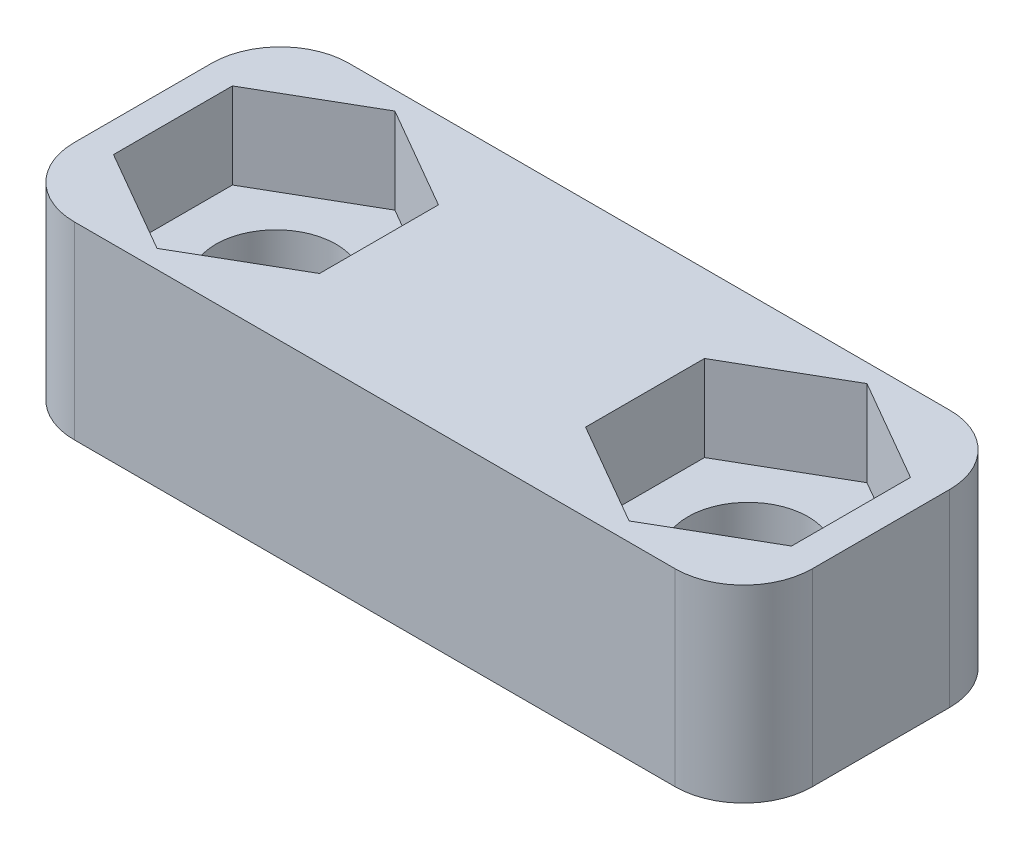
ISO-10303-21;
HEADER;
FILE_DESCRIPTION(('STEP AP214'),'2;1');
FILE_NAME('part.step','',(''),(''),'','','');
FILE_SCHEMA(('AUTOMOTIVE_DESIGN { 1 0 10303 214 1 1 1 1 }'));
ENDSEC;
DATA;
#1=APPLICATION_CONTEXT('core data for automotive mechanical design processes');
#2=APPLICATION_PROTOCOL_DEFINITION('international standard','automotive_design',2000,#1);
#3=PRODUCT_CONTEXT('',#1,'mechanical');
#4=PRODUCT('Part','Part','',(#3));
#5=PRODUCT_RELATED_PRODUCT_CATEGORY('part','',(#4));
#6=PRODUCT_DEFINITION_FORMATION('','',#4);
#7=PRODUCT_DEFINITION_CONTEXT('part definition',#1,'design');
#8=PRODUCT_DEFINITION('design','',#6,#7);
#9=PRODUCT_DEFINITION_SHAPE('','',#8);
#10=(LENGTH_UNIT() NAMED_UNIT(*) SI_UNIT(.MILLI.,.METRE.));
#11=(NAMED_UNIT(*) PLANE_ANGLE_UNIT() SI_UNIT($,.RADIAN.));
#12=(NAMED_UNIT(*) SI_UNIT($,.STERADIAN.) SOLID_ANGLE_UNIT());
#13=UNCERTAINTY_MEASURE_WITH_UNIT(LENGTH_MEASURE(1.E-05),#10,'distance_accuracy_value','');
#14=(GEOMETRIC_REPRESENTATION_CONTEXT(3) GLOBAL_UNCERTAINTY_ASSIGNED_CONTEXT((#13)) GLOBAL_UNIT_ASSIGNED_CONTEXT((#10,
#11,#12)) REPRESENTATION_CONTEXT('',''));
#15=CARTESIAN_POINT('',(0.,0.,0.));
#16=DIRECTION('',(0.,0.,1.));
#17=DIRECTION('',(1.,0.,0.));
#18=AXIS2_PLACEMENT_3D('',#15,#16,#17);
#19=CARTESIAN_POINT('',(0.,-5.5,8.));
#20=DIRECTION('',(0.,1.,0.));
#21=DIRECTION('',(0.,0.,1.));
#22=AXIS2_PLACEMENT_3D('',#19,#20,#21);
#23=PLANE('',#22);
#24=DIRECTION('',(0.,0.,-1.));
#25=VECTOR('',#24,1.);
#26=CARTESIAN_POINT('',(0.,-5.5,8.));
#27=LINE('',#26,#25);
#28=CARTESIAN_POINT('',(0.,-5.5,6.));
#29=VERTEX_POINT('',#28);
#30=CARTESIAN_POINT('',(0.,-5.5,2.));
#31=VERTEX_POINT('',#30);
#32=EDGE_CURVE('E403',#29,#31,#27,.T.);
#33=ORIENTED_EDGE('',*,*,#32,.T.);
#34=CARTESIAN_POINT('',(2.,-5.5,2.));
#35=DIRECTION('',(0.,1.,0.));
#36=DIRECTION('',(0.,0.,1.));
#37=AXIS2_PLACEMENT_3D('',#34,#35,#36);
#38=CIRCLE('',#37,2.);
#39=CARTESIAN_POINT('',(2.,-5.5,0.));
#40=VERTEX_POINT('',#39);
#41=EDGE_CURVE('E424',#31,#40,#38,.F.);
#42=ORIENTED_EDGE('',*,*,#41,.T.);
#43=DIRECTION('',(1.,0.,0.));
#44=VECTOR('',#43,1.);
#45=CARTESIAN_POINT('',(0.,-5.5,0.));
#46=LINE('',#45,#44);
#47=CARTESIAN_POINT('',(19.5,-5.5,0.));
#48=VERTEX_POINT('',#47);
#49=EDGE_CURVE('E391',#40,#48,#46,.T.);
#50=ORIENTED_EDGE('',*,*,#49,.T.);
#51=CARTESIAN_POINT('',(19.5,-5.5,2.));
#52=DIRECTION('',(0.,1.,0.));
#53=DIRECTION('',(0.,0.,1.));
#54=AXIS2_PLACEMENT_3D('',#51,#52,#53);
#55=CIRCLE('',#54,2.);
#56=CARTESIAN_POINT('',(21.5,-5.5,2.));
#57=VERTEX_POINT('',#56);
#58=EDGE_CURVE('E418',#48,#57,#55,.F.);
#59=ORIENTED_EDGE('',*,*,#58,.T.);
#60=DIRECTION('',(0.,0.,-1.));
#61=VECTOR('',#60,1.);
#62=CARTESIAN_POINT('',(21.5,-5.5,8.));
#63=LINE('',#62,#61);
#64=CARTESIAN_POINT('',(21.5,-5.5,6.));
#65=VERTEX_POINT('',#64);
#66=EDGE_CURVE('E400',#65,#57,#63,.T.);
#67=ORIENTED_EDGE('',*,*,#66,.F.);
#68=CARTESIAN_POINT('',(19.5,-5.5,6.));
#69=DIRECTION('',(0.,1.,0.));
#70=DIRECTION('',(0.,0.,1.));
#71=AXIS2_PLACEMENT_3D('',#68,#69,#70);
#72=CIRCLE('',#71,2.);
#73=CARTESIAN_POINT('',(19.5,-5.5,8.));
#74=VERTEX_POINT('',#73);
#75=EDGE_CURVE('E420',#65,#74,#72,.F.);
#76=ORIENTED_EDGE('',*,*,#75,.T.);
#77=DIRECTION('',(1.,0.,0.));
#78=VECTOR('',#77,1.);
#79=CARTESIAN_POINT('',(0.,-5.5,8.));
#80=LINE('',#79,#78);
#81=CARTESIAN_POINT('',(2.,-5.5,8.));
#82=VERTEX_POINT('',#81);
#83=EDGE_CURVE('E390',#82,#74,#80,.T.);
#84=ORIENTED_EDGE('',*,*,#83,.F.);
#85=CARTESIAN_POINT('',(2.,-5.5,6.));
#86=DIRECTION('',(0.,1.,0.));
#87=DIRECTION('',(0.,0.,1.));
#88=AXIS2_PLACEMENT_3D('',#85,#86,#87);
#89=CIRCLE('',#88,2.);
#90=EDGE_CURVE('E422',#82,#29,#89,.F.);
#91=ORIENTED_EDGE('',*,*,#90,.T.);
#92=EDGE_LOOP('',(#33,#42,#50,#59,#67,#76,#84,#91));
#93=FACE_BOUND('',#92,.T.);
#94=CARTESIAN_POINT('',(17.625,-5.5,4.));
#95=DIRECTION('',(0.,-1.,0.));
#96=DIRECTION('',(0.,0.,-1.));
#97=AXIS2_PLACEMENT_3D('',#94,#95,#96);
#98=CIRCLE('',#97,1.75);
#99=CARTESIAN_POINT('',(17.625,-5.5,2.25));
#100=VERTEX_POINT('',#99);
#101=EDGE_CURVE('E383',#100,#100,#98,.T.);
#102=ORIENTED_EDGE('',*,*,#101,.F.);
#103=EDGE_LOOP('',(#102));
#104=FACE_BOUND('',#103,.T.);
#105=CARTESIAN_POINT('',(3.875,-5.5,4.));
#106=DIRECTION('',(0.,-1.,0.));
#107=DIRECTION('',(0.,0.,-1.));
#108=AXIS2_PLACEMENT_3D('',#105,#106,#107);
#109=CIRCLE('',#108,1.75);
#110=CARTESIAN_POINT('',(3.875,-5.5,2.25));
#111=VERTEX_POINT('',#110);
#112=EDGE_CURVE('E379',#111,#111,#109,.T.);
#113=ORIENTED_EDGE('',*,*,#112,.F.);
#114=EDGE_LOOP('',(#113));
#115=FACE_BOUND('',#114,.T.);
#116=DIRECTION('',(0.,0.,-1.));
#117=VECTOR('',#116,1.);
#118=CARTESIAN_POINT('',(7.5,-5.5,2.));
#119=LINE('',#118,#117);
#120=CARTESIAN_POINT('',(7.5,-5.5,2.));
#121=VERTEX_POINT('',#120);
#122=CARTESIAN_POINT('',(7.5,-5.5,1.));
#123=VERTEX_POINT('',#122);
#124=EDGE_CURVE('E275',#121,#123,#119,.T.);
#125=ORIENTED_EDGE('',*,*,#124,.F.);
#126=DIRECTION('',(-1.,0.,0.));
#127=VECTOR('',#126,1.);
#128=CARTESIAN_POINT('',(7.5,-5.5,2.));
#129=LINE('',#128,#127);
#130=CARTESIAN_POINT('',(14.,-5.5,2.));
#131=VERTEX_POINT('',#130);
#132=EDGE_CURVE('E272',#131,#121,#129,.T.);
#133=ORIENTED_EDGE('',*,*,#132,.F.);
#134=DIRECTION('',(0.,0.,-1.));
#135=VECTOR('',#134,1.);
#136=CARTESIAN_POINT('',(14.,-5.5,2.));
#137=LINE('',#136,#135);
#138=CARTESIAN_POINT('',(14.,-5.5,1.));
#139=VERTEX_POINT('',#138);
#140=EDGE_CURVE('E286',#131,#139,#137,.T.);
#141=ORIENTED_EDGE('',*,*,#140,.T.);
#142=DIRECTION('',(-1.,0.,0.));
#143=VECTOR('',#142,1.);
#144=CARTESIAN_POINT('',(7.5,-5.5,1.));
#145=LINE('',#144,#143);
#146=EDGE_CURVE('E267',#139,#123,#145,.T.);
#147=ORIENTED_EDGE('',*,*,#146,.T.);
#148=EDGE_LOOP('',(#125,#133,#141,#147));
#149=FACE_BOUND('',#148,.T.);
#150=DIRECTION('',(-1.,0.,0.));
#151=VECTOR('',#150,1.);
#152=CARTESIAN_POINT('',(14.,-5.5,6.));
#153=LINE('',#152,#151);
#154=CARTESIAN_POINT('',(14.,-5.5,6.));
#155=VERTEX_POINT('',#154);
#156=CARTESIAN_POINT('',(7.5,-5.5,6.));
#157=VERTEX_POINT('',#156);
#158=EDGE_CURVE('E238',#155,#157,#153,.T.);
#159=ORIENTED_EDGE('',*,*,#158,.T.);
#160=DIRECTION('',(0.,0.,1.));
#161=VECTOR('',#160,1.);
#162=CARTESIAN_POINT('',(7.5,-5.5,6.));
#163=LINE('',#162,#161);
#164=CARTESIAN_POINT('',(7.5,-5.5,7.));
#165=VERTEX_POINT('',#164);
#166=EDGE_CURVE('E221',#157,#165,#163,.T.);
#167=ORIENTED_EDGE('',*,*,#166,.T.);
#168=DIRECTION('',(-1.,0.,0.));
#169=VECTOR('',#168,1.);
#170=CARTESIAN_POINT('',(14.,-5.5,7.));
#171=LINE('',#170,#169);
#172=CARTESIAN_POINT('',(14.,-5.5,7.));
#173=VERTEX_POINT('',#172);
#174=EDGE_CURVE('E253',#173,#165,#171,.T.);
#175=ORIENTED_EDGE('',*,*,#174,.F.);
#176=DIRECTION('',(0.,0.,1.));
#177=VECTOR('',#176,1.);
#178=CARTESIAN_POINT('',(14.,-5.5,6.));
#179=LINE('',#178,#177);
#180=EDGE_CURVE('E245',#155,#173,#179,.T.);
#181=ORIENTED_EDGE('',*,*,#180,.F.);
#182=EDGE_LOOP('',(#159,#167,#175,#181));
#183=FACE_BOUND('',#182,.T.);
#184=ADVANCED_FACE('F35',(#93,#104,#115,#149,#183),#23,.F.);
#185=CARTESIAN_POINT('',(17.625,0.,4.));
#186=DIRECTION('',(0.,-1.,0.));
#187=DIRECTION('',(0.,0.,-1.));
#188=AXIS2_PLACEMENT_3D('',#185,#186,#187);
#189=CYLINDRICAL_SURFACE('',#188,1.75);
#190=ORIENTED_EDGE('',*,*,#101,.T.);
#191=EDGE_LOOP('',(#190));
#192=FACE_BOUND('',#191,.T.);
#193=CARTESIAN_POINT('',(17.625,-2.5,4.));
#194=DIRECTION('',(0.,1.,0.));
#195=DIRECTION('',(0.,0.,1.));
#196=AXIS2_PLACEMENT_3D('',#193,#194,#195);
#197=CIRCLE('',#196,1.75);
#198=CARTESIAN_POINT('',(17.625,-2.5,5.75));
#199=VERTEX_POINT('',#198);
#200=EDGE_CURVE('E386',#199,#199,#197,.F.);
#201=ORIENTED_EDGE('',*,*,#200,.F.);
#202=EDGE_LOOP('',(#201));
#203=FACE_BOUND('',#202,.T.);
#204=ADVANCED_FACE('F481',(#192,#203),#189,.F.);
#205=CARTESIAN_POINT('',(3.875,0.,4.));
#206=DIRECTION('',(0.,-1.,0.));
#207=DIRECTION('',(0.,0.,-1.));
#208=AXIS2_PLACEMENT_3D('',#205,#206,#207);
#209=CYLINDRICAL_SURFACE('',#208,1.75);
#210=ORIENTED_EDGE('',*,*,#112,.T.);
#211=EDGE_LOOP('',(#210));
#212=FACE_BOUND('',#211,.T.);
#213=CARTESIAN_POINT('',(3.875,-2.5,4.));
#214=DIRECTION('',(0.,1.,0.));
#215=DIRECTION('',(0.,0.,1.));
#216=AXIS2_PLACEMENT_3D('',#213,#214,#215);
#217=CIRCLE('',#216,1.75);
#218=CARTESIAN_POINT('',(3.875,-2.5,5.75));
#219=VERTEX_POINT('',#218);
#220=EDGE_CURVE('E338',#219,#219,#217,.F.);
#221=ORIENTED_EDGE('',*,*,#220,.F.);
#222=EDGE_LOOP('',(#221));
#223=FACE_BOUND('',#222,.T.);
#224=ADVANCED_FACE('F486',(#212,#223),#209,.F.);
#225=CARTESIAN_POINT('',(0.,0.,8.));
#226=DIRECTION('',(0.,-1.,0.));
#227=DIRECTION('',(0.,0.,-1.));
#228=AXIS2_PLACEMENT_3D('',#225,#226,#227);
#229=PLANE('',#228);
#230=DIRECTION('',(0.,0.,-1.));
#231=VECTOR('',#230,1.);
#232=CARTESIAN_POINT('',(6.875,0.,5.73205080756888));
#233=LINE('',#232,#231);
#234=CARTESIAN_POINT('',(6.875,0.,5.73205080756888));
#235=VERTEX_POINT('',#234);
#236=CARTESIAN_POINT('',(6.875,0.,2.26794919243112));
#237=VERTEX_POINT('',#236);
#238=EDGE_CURVE('E309',#235,#237,#233,.T.);
#239=ORIENTED_EDGE('',*,*,#238,.F.);
#240=DIRECTION('',(0.866025403784438,0.,-0.5));
#241=VECTOR('',#240,1.);
#242=CARTESIAN_POINT('',(3.875,0.,7.46410161513776));
#243=LINE('',#242,#241);
#244=CARTESIAN_POINT('',(3.875,0.,7.46410161513776));
#245=VERTEX_POINT('',#244);
#246=EDGE_CURVE('E307',#245,#235,#243,.T.);
#247=ORIENTED_EDGE('',*,*,#246,.F.);
#248=DIRECTION('',(0.866025403784439,0.,0.5));
#249=VECTOR('',#248,1.);
#250=CARTESIAN_POINT('',(0.875,0.,5.73205080756888));
#251=LINE('',#250,#249);
#252=CARTESIAN_POINT('',(0.875,0.,5.73205080756888));
#253=VERTEX_POINT('',#252);
#254=EDGE_CURVE('E322',#253,#245,#251,.T.);
#255=ORIENTED_EDGE('',*,*,#254,.F.);
#256=DIRECTION('',(0.,0.,1.));
#257=VECTOR('',#256,1.);
#258=CARTESIAN_POINT('',(0.874999999999999,0.,2.26794919243112));
#259=LINE('',#258,#257);
#260=CARTESIAN_POINT('',(0.874999999999999,0.,2.26794919243112));
#261=VERTEX_POINT('',#260);
#262=EDGE_CURVE('E319',#261,#253,#259,.T.);
#263=ORIENTED_EDGE('',*,*,#262,.F.);
#264=DIRECTION('',(-0.866025403784438,0.,0.5));
#265=VECTOR('',#264,1.);
#266=CARTESIAN_POINT('',(3.875,0.,0.535898384862245));
#267=LINE('',#266,#265);
#268=CARTESIAN_POINT('',(3.875,0.,0.535898384862245));
#269=VERTEX_POINT('',#268);
#270=EDGE_CURVE('E316',#269,#261,#267,.T.);
#271=ORIENTED_EDGE('',*,*,#270,.F.);
#272=DIRECTION('',(-0.866025403784439,0.,-0.5));
#273=VECTOR('',#272,1.);
#274=CARTESIAN_POINT('',(6.875,0.,2.26794919243112));
#275=LINE('',#274,#273);
#276=EDGE_CURVE('E313',#237,#269,#275,.T.);
#277=ORIENTED_EDGE('',*,*,#276,.F.);
#278=EDGE_LOOP('',(#239,#247,#255,#263,#271,#277));
#279=FACE_BOUND('',#278,.T.);
#280=DIRECTION('',(-0.866025403784439,0.,-0.5));
#281=VECTOR('',#280,1.);
#282=CARTESIAN_POINT('',(20.625,0.,2.26794919243112));
#283=LINE('',#282,#281);
#284=CARTESIAN_POINT('',(20.625,0.,2.26794919243112));
#285=VERTEX_POINT('',#284);
#286=CARTESIAN_POINT('',(17.625,0.,0.535898384862245));
#287=VERTEX_POINT('',#286);
#288=EDGE_CURVE('E351',#285,#287,#283,.T.);
#289=ORIENTED_EDGE('',*,*,#288,.F.);
#290=DIRECTION('',(0.,0.,-1.));
#291=VECTOR('',#290,1.);
#292=CARTESIAN_POINT('',(20.625,0.,5.73205080756887));
#293=LINE('',#292,#291);
#294=CARTESIAN_POINT('',(20.625,0.,5.73205080756887));
#295=VERTEX_POINT('',#294);
#296=EDGE_CURVE('E294',#295,#285,#293,.T.);
#297=ORIENTED_EDGE('',*,*,#296,.F.);
#298=DIRECTION('',(0.866025403784438,0.,-0.5));
#299=VECTOR('',#298,1.);
#300=CARTESIAN_POINT('',(17.625,0.,7.46410161513775));
#301=LINE('',#300,#299);
#302=CARTESIAN_POINT('',(17.625,0.,7.46410161513775));
#303=VERTEX_POINT('',#302);
#304=EDGE_CURVE('E363',#303,#295,#301,.T.);
#305=ORIENTED_EDGE('',*,*,#304,.F.);
#306=DIRECTION('',(0.866025403784439,0.,0.5));
#307=VECTOR('',#306,1.);
#308=CARTESIAN_POINT('',(14.625,0.,5.73205080756888));
#309=LINE('',#308,#307);
#310=CARTESIAN_POINT('',(14.625,0.,5.73205080756888));
#311=VERTEX_POINT('',#310);
#312=EDGE_CURVE('E360',#311,#303,#309,.T.);
#313=ORIENTED_EDGE('',*,*,#312,.F.);
#314=DIRECTION('',(0.,0.,1.));
#315=VECTOR('',#314,1.);
#316=CARTESIAN_POINT('',(14.625,0.,2.26794919243112));
#317=LINE('',#316,#315);
#318=CARTESIAN_POINT('',(14.625,0.,2.26794919243112));
#319=VERTEX_POINT('',#318);
#320=EDGE_CURVE('E357',#319,#311,#317,.T.);
#321=ORIENTED_EDGE('',*,*,#320,.F.);
#322=DIRECTION('',(-0.866025403784439,0.,0.5));
#323=VECTOR('',#322,1.);
#324=CARTESIAN_POINT('',(17.625,0.,0.535898384862245));
#325=LINE('',#324,#323);
#326=EDGE_CURVE('E354',#287,#319,#325,.T.);
#327=ORIENTED_EDGE('',*,*,#326,.F.);
#328=EDGE_LOOP('',(#289,#297,#305,#313,#321,#327));
#329=FACE_BOUND('',#328,.T.);
#330=DIRECTION('',(-1.,0.,0.));
#331=VECTOR('',#330,1.);
#332=CARTESIAN_POINT('',(0.,0.,0.));
#333=LINE('',#332,#331);
#334=CARTESIAN_POINT('',(19.5,0.,0.));
#335=VERTEX_POINT('',#334);
#336=CARTESIAN_POINT('',(2.,0.,0.));
#337=VERTEX_POINT('',#336);
#338=EDGE_CURVE('E382',#335,#337,#333,.T.);
#339=ORIENTED_EDGE('',*,*,#338,.T.);
#340=CARTESIAN_POINT('',(2.,0.,2.));
#341=DIRECTION('',(0.,-1.,0.));
#342=DIRECTION('',(0.,0.,-1.));
#343=AXIS2_PLACEMENT_3D('',#340,#341,#342);
#344=CIRCLE('',#343,2.);
#345=CARTESIAN_POINT('',(0.,0.,2.));
#346=VERTEX_POINT('',#345);
#347=EDGE_CURVE('E434',#337,#346,#344,.F.);
#348=ORIENTED_EDGE('',*,*,#347,.T.);
#349=DIRECTION('',(0.,0.,-1.));
#350=VECTOR('',#349,1.);
#351=CARTESIAN_POINT('',(0.,0.,8.));
#352=LINE('',#351,#350);
#353=CARTESIAN_POINT('',(0.,0.,6.));
#354=VERTEX_POINT('',#353);
#355=EDGE_CURVE('E406',#354,#346,#352,.T.);
#356=ORIENTED_EDGE('',*,*,#355,.F.);
#357=CARTESIAN_POINT('',(2.,0.,6.));
#358=DIRECTION('',(0.,-1.,0.));
#359=DIRECTION('',(0.,0.,-1.));
#360=AXIS2_PLACEMENT_3D('',#357,#358,#359);
#361=CIRCLE('',#360,2.);
#362=CARTESIAN_POINT('',(2.,0.,8.));
#363=VERTEX_POINT('',#362);
#364=EDGE_CURVE('E432',#354,#363,#361,.F.);
#365=ORIENTED_EDGE('',*,*,#364,.T.);
#366=DIRECTION('',(-1.,0.,0.));
#367=VECTOR('',#366,1.);
#368=CARTESIAN_POINT('',(0.,0.,8.));
#369=LINE('',#368,#367);
#370=CARTESIAN_POINT('',(19.5,0.,8.));
#371=VERTEX_POINT('',#370);
#372=EDGE_CURVE('E387',#371,#363,#369,.T.);
#373=ORIENTED_EDGE('',*,*,#372,.F.);
#374=CARTESIAN_POINT('',(19.5,0.,6.));
#375=DIRECTION('',(0.,-1.,0.));
#376=DIRECTION('',(0.,0.,-1.));
#377=AXIS2_PLACEMENT_3D('',#374,#375,#376);
#378=CIRCLE('',#377,2.);
#379=CARTESIAN_POINT('',(21.5,0.,6.));
#380=VERTEX_POINT('',#379);
#381=EDGE_CURVE('E58',#371,#380,#378,.F.);
#382=ORIENTED_EDGE('',*,*,#381,.T.);
#383=DIRECTION('',(0.,0.,-1.));
#384=VECTOR('',#383,1.);
#385=CARTESIAN_POINT('',(21.5,0.,8.));
#386=LINE('',#385,#384);
#387=CARTESIAN_POINT('',(21.5,0.,2.));
#388=VERTEX_POINT('',#387);
#389=EDGE_CURVE('E394',#380,#388,#386,.T.);
#390=ORIENTED_EDGE('',*,*,#389,.T.);
#391=CARTESIAN_POINT('',(19.5,0.,2.));
#392=DIRECTION('',(0.,-1.,0.));
#393=DIRECTION('',(0.,0.,-1.));
#394=AXIS2_PLACEMENT_3D('',#391,#392,#393);
#395=CIRCLE('',#394,2.);
#396=EDGE_CURVE('E50',#388,#335,#395,.F.);
#397=ORIENTED_EDGE('',*,*,#396,.T.);
#398=EDGE_LOOP('',(#339,#348,#356,#365,#373,#382,#390,#397));
#399=FACE_BOUND('',#398,.T.);
#400=ADVANCED_FACE('F446',(#279,#329,#399),#229,.F.);
#401=CARTESIAN_POINT('',(0.,0.,8.));
#402=DIRECTION('',(1.,0.,0.));
#403=DIRECTION('',(0.,0.,-1.));
#404=AXIS2_PLACEMENT_3D('',#401,#402,#403);
#405=PLANE('',#404);
#406=ORIENTED_EDGE('',*,*,#355,.T.);
#407=DIRECTION('',(0.,-1.,0.));
#408=VECTOR('',#407,1.);
#409=CARTESIAN_POINT('',(0.,-5.5,2.));
#410=LINE('',#409,#408);
#411=EDGE_CURVE('E415',#346,#31,#410,.T.);
#412=ORIENTED_EDGE('',*,*,#411,.T.);
#413=ORIENTED_EDGE('',*,*,#32,.F.);
#414=DIRECTION('',(0.,-1.,0.));
#415=VECTOR('',#414,1.);
#416=CARTESIAN_POINT('',(0.,0.,6.));
#417=LINE('',#416,#415);
#418=EDGE_CURVE('E409',#29,#354,#417,.F.);
#419=ORIENTED_EDGE('',*,*,#418,.T.);
#420=EDGE_LOOP('',(#406,#412,#413,#419));
#421=FACE_BOUND('',#420,.T.);
#422=ADVANCED_FACE('F462',(#421),#405,.F.);
#423=CARTESIAN_POINT('',(21.5,0.,8.));
#424=DIRECTION('',(-1.,0.,0.));
#425=DIRECTION('',(0.,0.,1.));
#426=AXIS2_PLACEMENT_3D('',#423,#424,#425);
#427=PLANE('',#426);
#428=ORIENTED_EDGE('',*,*,#389,.F.);
#429=DIRECTION('',(0.,1.,0.));
#430=VECTOR('',#429,1.);
#431=CARTESIAN_POINT('',(21.5,0.,6.));
#432=LINE('',#431,#430);
#433=EDGE_CURVE('E12',#380,#65,#432,.F.);
#434=ORIENTED_EDGE('',*,*,#433,.T.);
#435=ORIENTED_EDGE('',*,*,#66,.T.);
#436=DIRECTION('',(0.,1.,0.));
#437=VECTOR('',#436,1.);
#438=CARTESIAN_POINT('',(21.5,0.,2.));
#439=LINE('',#438,#437);
#440=EDGE_CURVE('E43',#57,#388,#439,.T.);
#441=ORIENTED_EDGE('',*,*,#440,.T.);
#442=EDGE_LOOP('',(#428,#434,#435,#441));
#443=FACE_BOUND('',#442,.T.);
#444=ADVANCED_FACE('F442',(#443),#427,.F.);
#445=CARTESIAN_POINT('',(0.,0.,8.));
#446=DIRECTION('',(0.,0.,-1.));
#447=DIRECTION('',(-1.,0.,0.));
#448=AXIS2_PLACEMENT_3D('',#445,#446,#447);
#449=PLANE('',#448);
#450=ORIENTED_EDGE('',*,*,#372,.T.);
#451=DIRECTION('',(0.,-1.,0.));
#452=VECTOR('',#451,1.);
#453=CARTESIAN_POINT('',(2.,0.,8.));
#454=LINE('',#453,#452);
#455=EDGE_CURVE('E439',#363,#82,#454,.T.);
#456=ORIENTED_EDGE('',*,*,#455,.T.);
#457=ORIENTED_EDGE('',*,*,#83,.T.);
#458=DIRECTION('',(0.,1.,0.));
#459=VECTOR('',#458,1.);
#460=CARTESIAN_POINT('',(19.5,0.,8.));
#461=LINE('',#460,#459);
#462=EDGE_CURVE('E436',#74,#371,#461,.T.);
#463=ORIENTED_EDGE('',*,*,#462,.T.);
#464=EDGE_LOOP('',(#450,#456,#457,#463));
#465=FACE_BOUND('',#464,.T.);
#466=ADVANCED_FACE('F469',(#465),#449,.F.);
#467=CARTESIAN_POINT('',(0.,0.,0.));
#468=DIRECTION('',(0.,0.,-1.));
#469=DIRECTION('',(-1.,0.,0.));
#470=AXIS2_PLACEMENT_3D('',#467,#468,#469);
#471=PLANE('',#470);
#472=ORIENTED_EDGE('',*,*,#49,.F.);
#473=DIRECTION('',(0.,-1.,0.));
#474=VECTOR('',#473,1.);
#475=CARTESIAN_POINT('',(2.,0.,0.));
#476=LINE('',#475,#474);
#477=EDGE_CURVE('E428',#40,#337,#476,.F.);
#478=ORIENTED_EDGE('',*,*,#477,.T.);
#479=ORIENTED_EDGE('',*,*,#338,.F.);
#480=DIRECTION('',(0.,1.,0.));
#481=VECTOR('',#480,1.);
#482=CARTESIAN_POINT('',(19.5,-5.5,0.));
#483=LINE('',#482,#481);
#484=EDGE_CURVE('E426',#335,#48,#483,.F.);
#485=ORIENTED_EDGE('',*,*,#484,.T.);
#486=EDGE_LOOP('',(#472,#478,#479,#485));
#487=FACE_BOUND('',#486,.T.);
#488=ADVANCED_FACE('F451',(#487),#471,.T.);
#489=CARTESIAN_POINT('',(0.,-2.5,8.));
#490=DIRECTION('',(0.,1.,0.));
#491=DIRECTION('',(0.,0.,1.));
#492=AXIS2_PLACEMENT_3D('',#489,#490,#491);
#493=PLANE('',#492);
#494=DIRECTION('',(-0.866025403784438,0.,0.5));
#495=VECTOR('',#494,1.);
#496=CARTESIAN_POINT('',(3.875,-2.5,7.46410161513776));
#497=LINE('',#496,#495);
#498=CARTESIAN_POINT('',(6.875,-2.5,5.73205080756888));
#499=VERTEX_POINT('',#498);
#500=CARTESIAN_POINT('',(3.875,-2.5,7.46410161513776));
#501=VERTEX_POINT('',#500);
#502=EDGE_CURVE('E304',#499,#501,#497,.T.);
#503=ORIENTED_EDGE('',*,*,#502,.F.);
#504=DIRECTION('',(0.,0.,1.));
#505=VECTOR('',#504,1.);
#506=CARTESIAN_POINT('',(6.875,-2.5,5.73205080756888));
#507=LINE('',#506,#505);
#508=CARTESIAN_POINT('',(6.875,-2.5,2.26794919243112));
#509=VERTEX_POINT('',#508);
#510=EDGE_CURVE('E306',#509,#499,#507,.T.);
#511=ORIENTED_EDGE('',*,*,#510,.F.);
#512=DIRECTION('',(0.866025403784439,0.,0.5));
#513=VECTOR('',#512,1.);
#514=CARTESIAN_POINT('',(6.875,-2.5,2.26794919243112));
#515=LINE('',#514,#513);
#516=CARTESIAN_POINT('',(3.875,-2.5,0.535898384862245));
#517=VERTEX_POINT('',#516);
#518=EDGE_CURVE('E295',#517,#509,#515,.T.);
#519=ORIENTED_EDGE('',*,*,#518,.F.);
#520=DIRECTION('',(0.866025403784438,0.,-0.5));
#521=VECTOR('',#520,1.);
#522=CARTESIAN_POINT('',(3.875,-2.5,0.535898384862245));
#523=LINE('',#522,#521);
#524=CARTESIAN_POINT('',(0.874999999999999,-2.5,2.26794919243112));
#525=VERTEX_POINT('',#524);
#526=EDGE_CURVE('E297',#525,#517,#523,.T.);
#527=ORIENTED_EDGE('',*,*,#526,.F.);
#528=DIRECTION('',(0.,0.,-1.));
#529=VECTOR('',#528,1.);
#530=CARTESIAN_POINT('',(0.874999999999999,-2.5,2.26794919243112));
#531=LINE('',#530,#529);
#532=CARTESIAN_POINT('',(0.875,-2.5,5.73205080756888));
#533=VERTEX_POINT('',#532);
#534=EDGE_CURVE('E300',#533,#525,#531,.T.);
#535=ORIENTED_EDGE('',*,*,#534,.F.);
#536=DIRECTION('',(-0.866025403784439,0.,-0.5));
#537=VECTOR('',#536,1.);
#538=CARTESIAN_POINT('',(0.875,-2.5,5.73205080756888));
#539=LINE('',#538,#537);
#540=EDGE_CURVE('E302',#501,#533,#539,.T.);
#541=ORIENTED_EDGE('',*,*,#540,.F.);
#542=EDGE_LOOP('',(#503,#511,#519,#527,#535,#541));
#543=FACE_BOUND('',#542,.T.);
#544=ORIENTED_EDGE('',*,*,#220,.T.);
#545=EDGE_LOOP('',(#544));
#546=FACE_BOUND('',#545,.T.);
#547=ADVANCED_FACE('F540',(#543,#546),#493,.T.);
#548=CARTESIAN_POINT('',(3.875,-14.6651513899117,7.46410161513776));
#549=DIRECTION('',(0.5,0.,0.866025403784438));
#550=DIRECTION('',(0.866025403784438,0.,-0.5));
#551=AXIS2_PLACEMENT_3D('',#548,#549,#550);
#552=PLANE('',#551);
#553=ORIENTED_EDGE('',*,*,#502,.T.);
#554=DIRECTION('',(0.,1.,0.));
#555=VECTOR('',#554,1.);
#556=CARTESIAN_POINT('',(3.875,-14.6651513899117,7.46410161513776));
#557=LINE('',#556,#555);
#558=EDGE_CURVE('E298',#501,#245,#557,.T.);
#559=ORIENTED_EDGE('',*,*,#558,.T.);
#560=ORIENTED_EDGE('',*,*,#246,.T.);
#561=DIRECTION('',(0.,1.,0.));
#562=VECTOR('',#561,1.);
#563=CARTESIAN_POINT('',(6.875,-14.6651513899117,5.73205080756888));
#564=LINE('',#563,#562);
#565=EDGE_CURVE('E325',#499,#235,#564,.T.);
#566=ORIENTED_EDGE('',*,*,#565,.F.);
#567=EDGE_LOOP('',(#553,#559,#560,#566));
#568=FACE_BOUND('',#567,.T.);
#569=ADVANCED_FACE('F543',(#568),#552,.F.);
#570=CARTESIAN_POINT('',(0.875,-14.6651513899117,5.73205080756888));
#571=DIRECTION('',(-0.5,0.,0.866025403784439));
#572=DIRECTION('',(0.866025403784439,0.,0.5));
#573=AXIS2_PLACEMENT_3D('',#570,#571,#572);
#574=PLANE('',#573);
#575=ORIENTED_EDGE('',*,*,#540,.T.);
#576=DIRECTION('',(0.,1.,0.));
#577=VECTOR('',#576,1.);
#578=CARTESIAN_POINT('',(0.875,-14.6651513899117,5.73205080756888));
#579=LINE('',#578,#577);
#580=EDGE_CURVE('E327',#533,#253,#579,.T.);
#581=ORIENTED_EDGE('',*,*,#580,.T.);
#582=ORIENTED_EDGE('',*,*,#254,.T.);
#583=ORIENTED_EDGE('',*,*,#558,.F.);
#584=EDGE_LOOP('',(#575,#581,#582,#583));
#585=FACE_BOUND('',#584,.T.);
#586=ADVANCED_FACE('F545',(#585),#574,.F.);
#587=CARTESIAN_POINT('',(0.874999999999999,-14.6651513899117,2.26794919243112));
#588=DIRECTION('',(-1.,0.,0.));
#589=DIRECTION('',(0.,0.,1.));
#590=AXIS2_PLACEMENT_3D('',#587,#588,#589);
#591=PLANE('',#590);
#592=ORIENTED_EDGE('',*,*,#534,.T.);
#593=DIRECTION('',(0.,1.,0.));
#594=VECTOR('',#593,1.);
#595=CARTESIAN_POINT('',(0.874999999999999,-14.6651513899117,2.26794919243112));
#596=LINE('',#595,#594);
#597=EDGE_CURVE('E329',#525,#261,#596,.T.);
#598=ORIENTED_EDGE('',*,*,#597,.T.);
#599=ORIENTED_EDGE('',*,*,#262,.T.);
#600=ORIENTED_EDGE('',*,*,#580,.F.);
#601=EDGE_LOOP('',(#592,#598,#599,#600));
#602=FACE_BOUND('',#601,.T.);
#603=ADVANCED_FACE('F548',(#602),#591,.F.);
#604=CARTESIAN_POINT('',(3.875,-14.6651513899117,0.535898384862245));
#605=DIRECTION('',(-0.5,0.,-0.866025403784438));
#606=DIRECTION('',(-0.866025403784438,0.,0.5));
#607=AXIS2_PLACEMENT_3D('',#604,#605,#606);
#608=PLANE('',#607);
#609=ORIENTED_EDGE('',*,*,#526,.T.);
#610=DIRECTION('',(0.,1.,0.));
#611=VECTOR('',#610,1.);
#612=CARTESIAN_POINT('',(3.875,-14.6651513899117,0.535898384862245));
#613=LINE('',#612,#611);
#614=EDGE_CURVE('E331',#517,#269,#613,.T.);
#615=ORIENTED_EDGE('',*,*,#614,.T.);
#616=ORIENTED_EDGE('',*,*,#270,.T.);
#617=ORIENTED_EDGE('',*,*,#597,.F.);
#618=EDGE_LOOP('',(#609,#615,#616,#617));
#619=FACE_BOUND('',#618,.T.);
#620=ADVANCED_FACE('F552',(#619),#608,.F.);
#621=CARTESIAN_POINT('',(6.875,-14.6651513899117,2.26794919243112));
#622=DIRECTION('',(0.5,0.,-0.866025403784439));
#623=DIRECTION('',(-0.866025403784439,0.,-0.5));
#624=AXIS2_PLACEMENT_3D('',#621,#622,#623);
#625=PLANE('',#624);
#626=ORIENTED_EDGE('',*,*,#518,.T.);
#627=DIRECTION('',(0.,1.,0.));
#628=VECTOR('',#627,1.);
#629=CARTESIAN_POINT('',(6.875,-14.6651513899117,2.26794919243112));
#630=LINE('',#629,#628);
#631=EDGE_CURVE('E333',#509,#237,#630,.T.);
#632=ORIENTED_EDGE('',*,*,#631,.T.);
#633=ORIENTED_EDGE('',*,*,#276,.T.);
#634=ORIENTED_EDGE('',*,*,#614,.F.);
#635=EDGE_LOOP('',(#626,#632,#633,#634));
#636=FACE_BOUND('',#635,.T.);
#637=ADVANCED_FACE('F556',(#636),#625,.F.);
#638=CARTESIAN_POINT('',(6.875,-14.6651513899117,5.73205080756888));
#639=DIRECTION('',(1.,0.,0.));
#640=DIRECTION('',(0.,0.,-1.));
#641=AXIS2_PLACEMENT_3D('',#638,#639,#640);
#642=PLANE('',#641);
#643=ORIENTED_EDGE('',*,*,#510,.T.);
#644=ORIENTED_EDGE('',*,*,#565,.T.);
#645=ORIENTED_EDGE('',*,*,#238,.T.);
#646=ORIENTED_EDGE('',*,*,#631,.F.);
#647=EDGE_LOOP('',(#643,#644,#645,#646));
#648=FACE_BOUND('',#647,.T.);
#649=ADVANCED_FACE('F560',(#648),#642,.F.);
#650=CARTESIAN_POINT('',(0.,-2.5,8.));
#651=DIRECTION('',(0.,1.,0.));
#652=DIRECTION('',(0.,0.,1.));
#653=AXIS2_PLACEMENT_3D('',#650,#651,#652);
#654=PLANE('',#653);
#655=DIRECTION('',(0.,0.,1.));
#656=VECTOR('',#655,1.);
#657=CARTESIAN_POINT('',(20.625,-2.5,5.73205080756887));
#658=LINE('',#657,#656);
#659=CARTESIAN_POINT('',(20.625,-2.5,2.26794919243112));
#660=VERTEX_POINT('',#659);
#661=CARTESIAN_POINT('',(20.625,-2.5,5.73205080756887));
#662=VERTEX_POINT('',#661);
#663=EDGE_CURVE('E348',#660,#662,#658,.T.);
#664=ORIENTED_EDGE('',*,*,#663,.F.);
#665=DIRECTION('',(0.866025403784439,0.,0.5));
#666=VECTOR('',#665,1.);
#667=CARTESIAN_POINT('',(20.625,-2.5,2.26794919243112));
#668=LINE('',#667,#666);
#669=CARTESIAN_POINT('',(17.625,-2.5,0.535898384862245));
#670=VERTEX_POINT('',#669);
#671=EDGE_CURVE('E310',#670,#660,#668,.T.);
#672=ORIENTED_EDGE('',*,*,#671,.F.);
#673=DIRECTION('',(0.866025403784439,0.,-0.5));
#674=VECTOR('',#673,1.);
#675=CARTESIAN_POINT('',(17.625,-2.5,0.535898384862245));
#676=LINE('',#675,#674);
#677=CARTESIAN_POINT('',(14.625,-2.5,2.26794919243112));
#678=VERTEX_POINT('',#677);
#679=EDGE_CURVE('E339',#678,#670,#676,.T.);
#680=ORIENTED_EDGE('',*,*,#679,.F.);
#681=DIRECTION('',(0.,0.,-1.));
#682=VECTOR('',#681,1.);
#683=CARTESIAN_POINT('',(14.625,-2.5,2.26794919243112));
#684=LINE('',#683,#682);
#685=CARTESIAN_POINT('',(14.625,-2.5,5.73205080756888));
#686=VERTEX_POINT('',#685);
#687=EDGE_CURVE('E341',#686,#678,#684,.T.);
#688=ORIENTED_EDGE('',*,*,#687,.F.);
#689=DIRECTION('',(-0.866025403784439,0.,-0.5));
#690=VECTOR('',#689,1.);
#691=CARTESIAN_POINT('',(14.625,-2.5,5.73205080756888));
#692=LINE('',#691,#690);
#693=CARTESIAN_POINT('',(17.625,-2.5,7.46410161513775));
#694=VERTEX_POINT('',#693);
#695=EDGE_CURVE('E344',#694,#686,#692,.T.);
#696=ORIENTED_EDGE('',*,*,#695,.F.);
#697=DIRECTION('',(-0.866025403784439,0.,0.5));
#698=VECTOR('',#697,1.);
#699=CARTESIAN_POINT('',(17.625,-2.5,7.46410161513775));
#700=LINE('',#699,#698);
#701=EDGE_CURVE('E346',#662,#694,#700,.T.);
#702=ORIENTED_EDGE('',*,*,#701,.F.);
#703=EDGE_LOOP('',(#664,#672,#680,#688,#696,#702));
#704=FACE_BOUND('',#703,.T.);
#705=ORIENTED_EDGE('',*,*,#200,.T.);
#706=EDGE_LOOP('',(#705));
#707=FACE_BOUND('',#706,.T.);
#708=ADVANCED_FACE('F564',(#704,#707),#654,.T.);
#709=CARTESIAN_POINT('',(20.625,-14.6651513899117,5.73205080756887));
#710=DIRECTION('',(1.,0.,0.));
#711=DIRECTION('',(0.,0.,-1.));
#712=AXIS2_PLACEMENT_3D('',#709,#710,#711);
#713=PLANE('',#712);
#714=ORIENTED_EDGE('',*,*,#663,.T.);
#715=DIRECTION('',(0.,1.,0.));
#716=VECTOR('',#715,1.);
#717=CARTESIAN_POINT('',(20.625,-14.6651513899117,5.73205080756887));
#718=LINE('',#717,#716);
#719=EDGE_CURVE('E342',#662,#295,#718,.T.);
#720=ORIENTED_EDGE('',*,*,#719,.T.);
#721=ORIENTED_EDGE('',*,*,#296,.T.);
#722=DIRECTION('',(0.,1.,0.));
#723=VECTOR('',#722,1.);
#724=CARTESIAN_POINT('',(20.625,-14.6651513899117,2.26794919243112));
#725=LINE('',#724,#723);
#726=EDGE_CURVE('E366',#660,#285,#725,.T.);
#727=ORIENTED_EDGE('',*,*,#726,.F.);
#728=EDGE_LOOP('',(#714,#720,#721,#727));
#729=FACE_BOUND('',#728,.T.);
#730=ADVANCED_FACE('F571',(#729),#713,.F.);
#731=CARTESIAN_POINT('',(17.625,-14.6651513899117,7.46410161513775));
#732=DIRECTION('',(0.5,0.,0.866025403784439));
#733=DIRECTION('',(0.866025403784439,0.,-0.5));
#734=AXIS2_PLACEMENT_3D('',#731,#732,#733);
#735=PLANE('',#734);
#736=ORIENTED_EDGE('',*,*,#701,.T.);
#737=DIRECTION('',(0.,1.,0.));
#738=VECTOR('',#737,1.);
#739=CARTESIAN_POINT('',(17.625,-14.6651513899117,7.46410161513775));
#740=LINE('',#739,#738);
#741=EDGE_CURVE('E368',#694,#303,#740,.T.);
#742=ORIENTED_EDGE('',*,*,#741,.T.);
#743=ORIENTED_EDGE('',*,*,#304,.T.);
#744=ORIENTED_EDGE('',*,*,#719,.F.);
#745=EDGE_LOOP('',(#736,#742,#743,#744));
#746=FACE_BOUND('',#745,.T.);
#747=ADVANCED_FACE('F573',(#746),#735,.F.);
#748=CARTESIAN_POINT('',(14.625,-14.6651513899117,5.73205080756888));
#749=DIRECTION('',(-0.5,0.,0.866025403784439));
#750=DIRECTION('',(0.866025403784439,0.,0.5));
#751=AXIS2_PLACEMENT_3D('',#748,#749,#750);
#752=PLANE('',#751);
#753=ORIENTED_EDGE('',*,*,#695,.T.);
#754=DIRECTION('',(0.,1.,0.));
#755=VECTOR('',#754,1.);
#756=CARTESIAN_POINT('',(14.625,-14.6651513899117,5.73205080756888));
#757=LINE('',#756,#755);
#758=EDGE_CURVE('E370',#686,#311,#757,.T.);
#759=ORIENTED_EDGE('',*,*,#758,.T.);
#760=ORIENTED_EDGE('',*,*,#312,.T.);
#761=ORIENTED_EDGE('',*,*,#741,.F.);
#762=EDGE_LOOP('',(#753,#759,#760,#761));
#763=FACE_BOUND('',#762,.T.);
#764=ADVANCED_FACE('F576',(#763),#752,.F.);
#765=CARTESIAN_POINT('',(14.625,-14.6651513899117,2.26794919243112));
#766=DIRECTION('',(-1.,0.,0.));
#767=DIRECTION('',(0.,0.,1.));
#768=AXIS2_PLACEMENT_3D('',#765,#766,#767);
#769=PLANE('',#768);
#770=ORIENTED_EDGE('',*,*,#687,.T.);
#771=DIRECTION('',(0.,1.,0.));
#772=VECTOR('',#771,1.);
#773=CARTESIAN_POINT('',(14.625,-14.6651513899117,2.26794919243112));
#774=LINE('',#773,#772);
#775=EDGE_CURVE('E372',#678,#319,#774,.T.);
#776=ORIENTED_EDGE('',*,*,#775,.T.);
#777=ORIENTED_EDGE('',*,*,#320,.T.);
#778=ORIENTED_EDGE('',*,*,#758,.F.);
#779=EDGE_LOOP('',(#770,#776,#777,#778));
#780=FACE_BOUND('',#779,.T.);
#781=ADVANCED_FACE('F580',(#780),#769,.F.);
#782=CARTESIAN_POINT('',(17.625,-14.6651513899117,0.535898384862245));
#783=DIRECTION('',(-0.5,0.,-0.866025403784439));
#784=DIRECTION('',(-0.866025403784439,0.,0.5));
#785=AXIS2_PLACEMENT_3D('',#782,#783,#784);
#786=PLANE('',#785);
#787=ORIENTED_EDGE('',*,*,#679,.T.);
#788=DIRECTION('',(0.,1.,0.));
#789=VECTOR('',#788,1.);
#790=CARTESIAN_POINT('',(17.625,-14.6651513899117,0.535898384862245));
#791=LINE('',#790,#789);
#792=EDGE_CURVE('E374',#670,#287,#791,.T.);
#793=ORIENTED_EDGE('',*,*,#792,.T.);
#794=ORIENTED_EDGE('',*,*,#326,.T.);
#795=ORIENTED_EDGE('',*,*,#775,.F.);
#796=EDGE_LOOP('',(#787,#793,#794,#795));
#797=FACE_BOUND('',#796,.T.);
#798=ADVANCED_FACE('F584',(#797),#786,.F.);
#799=CARTESIAN_POINT('',(20.625,-14.6651513899117,2.26794919243112));
#800=DIRECTION('',(0.5,0.,-0.866025403784439));
#801=DIRECTION('',(-0.866025403784439,0.,-0.5));
#802=AXIS2_PLACEMENT_3D('',#799,#800,#801);
#803=PLANE('',#802);
#804=ORIENTED_EDGE('',*,*,#671,.T.);
#805=ORIENTED_EDGE('',*,*,#726,.T.);
#806=ORIENTED_EDGE('',*,*,#288,.T.);
#807=ORIENTED_EDGE('',*,*,#792,.F.);
#808=EDGE_LOOP('',(#804,#805,#806,#807));
#809=FACE_BOUND('',#808,.T.);
#810=ADVANCED_FACE('F538',(#809),#803,.F.);
#811=CARTESIAN_POINT('',(9.,-6.5,2.));
#812=DIRECTION('',(0.554700196225229,0.832050294337844,0.));
#813=DIRECTION('',(-0.832050294337844,0.554700196225229,0.));
#814=AXIS2_PLACEMENT_3D('',#811,#812,#813);
#815=PLANE('',#814);
#816=DIRECTION('',(0.832050294337844,-0.554700196225229,0.));
#817=VECTOR('',#816,1.);
#818=CARTESIAN_POINT('',(9.,-6.5,1.));
#819=LINE('',#818,#817);
#820=CARTESIAN_POINT('',(9.,-6.5,1.));
#821=VERTEX_POINT('',#820);
#822=EDGE_CURVE('E259',#123,#821,#819,.T.);
#823=ORIENTED_EDGE('',*,*,#822,.T.);
#824=DIRECTION('',(0.,0.,-1.));
#825=VECTOR('',#824,1.);
#826=CARTESIAN_POINT('',(9.,-6.5,2.));
#827=LINE('',#826,#825);
#828=CARTESIAN_POINT('',(9.,-6.5,2.));
#829=VERTEX_POINT('',#828);
#830=EDGE_CURVE('E291',#829,#821,#827,.T.);
#831=ORIENTED_EDGE('',*,*,#830,.F.);
#832=DIRECTION('',(0.832050294337844,-0.554700196225229,0.));
#833=VECTOR('',#832,1.);
#834=CARTESIAN_POINT('',(9.,-6.5,2.));
#835=LINE('',#834,#833);
#836=EDGE_CURVE('E263',#121,#829,#835,.T.);
#837=ORIENTED_EDGE('',*,*,#836,.F.);
#838=ORIENTED_EDGE('',*,*,#124,.T.);
#839=EDGE_LOOP('',(#823,#831,#837,#838));
#840=FACE_BOUND('',#839,.T.);
#841=ADVANCED_FACE('F534',(#840),#815,.F.);
#842=CARTESIAN_POINT('',(12.5,-6.5,2.));
#843=DIRECTION('',(0.,1.,0.));
#844=DIRECTION('',(0.,0.,1.));
#845=AXIS2_PLACEMENT_3D('',#842,#843,#844);
#846=PLANE('',#845);
#847=DIRECTION('',(1.,0.,0.));
#848=VECTOR('',#847,1.);
#849=CARTESIAN_POINT('',(12.5,-6.5,1.));
#850=LINE('',#849,#848);
#851=CARTESIAN_POINT('',(12.5,-6.5,1.));
#852=VERTEX_POINT('',#851);
#853=EDGE_CURVE('E278',#821,#852,#850,.T.);
#854=ORIENTED_EDGE('',*,*,#853,.T.);
#855=DIRECTION('',(0.,0.,-1.));
#856=VECTOR('',#855,1.);
#857=CARTESIAN_POINT('',(12.5,-6.5,2.));
#858=LINE('',#857,#856);
#859=CARTESIAN_POINT('',(12.5,-6.5,2.));
#860=VERTEX_POINT('',#859);
#861=EDGE_CURVE('E288',#860,#852,#858,.T.);
#862=ORIENTED_EDGE('',*,*,#861,.F.);
#863=DIRECTION('',(1.,0.,0.));
#864=VECTOR('',#863,1.);
#865=CARTESIAN_POINT('',(12.5,-6.5,2.));
#866=LINE('',#865,#864);
#867=EDGE_CURVE('E266',#829,#860,#866,.T.);
#868=ORIENTED_EDGE('',*,*,#867,.F.);
#869=ORIENTED_EDGE('',*,*,#830,.T.);
#870=EDGE_LOOP('',(#854,#862,#868,#869));
#871=FACE_BOUND('',#870,.T.);
#872=ADVANCED_FACE('F530',(#871),#846,.F.);
#873=CARTESIAN_POINT('',(14.,-5.5,2.));
#874=DIRECTION('',(-0.554700196225229,0.832050294337844,0.));
#875=DIRECTION('',(-0.832050294337844,-0.554700196225229,0.));
#876=AXIS2_PLACEMENT_3D('',#873,#874,#875);
#877=PLANE('',#876);
#878=DIRECTION('',(0.832050294337844,0.554700196225229,0.));
#879=VECTOR('',#878,1.);
#880=CARTESIAN_POINT('',(14.,-5.5,1.));
#881=LINE('',#880,#879);
#882=EDGE_CURVE('E280',#852,#139,#881,.T.);
#883=ORIENTED_EDGE('',*,*,#882,.T.);
#884=ORIENTED_EDGE('',*,*,#140,.F.);
#885=DIRECTION('',(0.832050294337844,0.554700196225229,0.));
#886=VECTOR('',#885,1.);
#887=CARTESIAN_POINT('',(14.,-5.5,2.));
#888=LINE('',#887,#886);
#889=EDGE_CURVE('E269',#860,#131,#888,.T.);
#890=ORIENTED_EDGE('',*,*,#889,.F.);
#891=ORIENTED_EDGE('',*,*,#861,.T.);
#892=EDGE_LOOP('',(#883,#884,#890,#891));
#893=FACE_BOUND('',#892,.T.);
#894=ADVANCED_FACE('F523',(#893),#877,.F.);
#895=CARTESIAN_POINT('',(0.,0.,2.));
#896=DIRECTION('',(0.,0.,1.));
#897=DIRECTION('',(1.,0.,0.));
#898=AXIS2_PLACEMENT_3D('',#895,#896,#897);
#899=PLANE('',#898);
#900=ORIENTED_EDGE('',*,*,#836,.T.);
#901=ORIENTED_EDGE('',*,*,#867,.T.);
#902=ORIENTED_EDGE('',*,*,#889,.T.);
#903=ORIENTED_EDGE('',*,*,#132,.T.);
#904=EDGE_LOOP('',(#900,#901,#902,#903));
#905=FACE_BOUND('',#904,.T.);
#906=ADVANCED_FACE('F520',(#905),#899,.T.);
#907=CARTESIAN_POINT('',(0.,0.,1.));
#908=DIRECTION('',(0.,0.,1.));
#909=DIRECTION('',(1.,0.,0.));
#910=AXIS2_PLACEMENT_3D('',#907,#908,#909);
#911=PLANE('',#910);
#912=ORIENTED_EDGE('',*,*,#822,.F.);
#913=ORIENTED_EDGE('',*,*,#146,.F.);
#914=ORIENTED_EDGE('',*,*,#882,.F.);
#915=ORIENTED_EDGE('',*,*,#853,.F.);
#916=EDGE_LOOP('',(#912,#913,#914,#915));
#917=FACE_BOUND('',#916,.T.);
#918=ADVANCED_FACE('F513',(#917),#911,.F.);
#919=CARTESIAN_POINT('',(12.5,-6.5,6.));
#920=DIRECTION('',(0.554700196225229,-0.832050294337844,0.));
#921=DIRECTION('',(0.832050294337844,0.554700196225229,0.));
#922=AXIS2_PLACEMENT_3D('',#919,#920,#921);
#923=PLANE('',#922);
#924=DIRECTION('',(0.832050294337844,0.554700196225229,0.));
#925=VECTOR('',#924,1.);
#926=CARTESIAN_POINT('',(12.5,-6.5,7.));
#927=LINE('',#926,#925);
#928=CARTESIAN_POINT('',(12.5,-6.5,7.));
#929=VERTEX_POINT('',#928);
#930=EDGE_CURVE('E246',#929,#173,#927,.T.);
#931=ORIENTED_EDGE('',*,*,#930,.F.);
#932=DIRECTION('',(0.,0.,1.));
#933=VECTOR('',#932,1.);
#934=CARTESIAN_POINT('',(12.5,-6.5,6.));
#935=LINE('',#934,#933);
#936=CARTESIAN_POINT('',(12.5,-6.5,6.));
#937=VERTEX_POINT('',#936);
#938=EDGE_CURVE('E260',#937,#929,#935,.T.);
#939=ORIENTED_EDGE('',*,*,#938,.F.);
#940=DIRECTION('',(0.832050294337844,0.554700196225229,0.));
#941=VECTOR('',#940,1.);
#942=CARTESIAN_POINT('',(12.5,-6.5,6.));
#943=LINE('',#942,#941);
#944=EDGE_CURVE('E232',#937,#155,#943,.T.);
#945=ORIENTED_EDGE('',*,*,#944,.T.);
#946=ORIENTED_EDGE('',*,*,#180,.T.);
#947=EDGE_LOOP('',(#931,#939,#945,#946));
#948=FACE_BOUND('',#947,.T.);
#949=ADVANCED_FACE('F509',(#948),#923,.T.);
#950=CARTESIAN_POINT('',(9.,-6.5,6.));
#951=DIRECTION('',(0.,-1.,0.));
#952=DIRECTION('',(0.,0.,-1.));
#953=AXIS2_PLACEMENT_3D('',#950,#951,#952);
#954=PLANE('',#953);
#955=DIRECTION('',(1.,0.,0.));
#956=VECTOR('',#955,1.);
#957=CARTESIAN_POINT('',(9.,-6.5,7.));
#958=LINE('',#957,#956);
#959=CARTESIAN_POINT('',(9.,-6.5,7.));
#960=VERTEX_POINT('',#959);
#961=EDGE_CURVE('E248',#960,#929,#958,.T.);
#962=ORIENTED_EDGE('',*,*,#961,.F.);
#963=DIRECTION('',(0.,0.,1.));
#964=VECTOR('',#963,1.);
#965=CARTESIAN_POINT('',(9.,-6.5,6.));
#966=LINE('',#965,#964);
#967=CARTESIAN_POINT('',(9.,-6.5,6.));
#968=VERTEX_POINT('',#967);
#969=EDGE_CURVE('E231',#968,#960,#966,.T.);
#970=ORIENTED_EDGE('',*,*,#969,.F.);
#971=DIRECTION('',(1.,0.,0.));
#972=VECTOR('',#971,1.);
#973=CARTESIAN_POINT('',(9.,-6.5,6.));
#974=LINE('',#973,#972);
#975=EDGE_CURVE('E241',#968,#937,#974,.T.);
#976=ORIENTED_EDGE('',*,*,#975,.T.);
#977=ORIENTED_EDGE('',*,*,#938,.T.);
#978=EDGE_LOOP('',(#962,#970,#976,#977));
#979=FACE_BOUND('',#978,.T.);
#980=ADVANCED_FACE('F512',(#979),#954,.T.);
#981=CARTESIAN_POINT('',(7.5,-5.5,6.));
#982=DIRECTION('',(-0.554700196225229,-0.832050294337844,0.));
#983=DIRECTION('',(0.832050294337844,-0.554700196225229,0.));
#984=AXIS2_PLACEMENT_3D('',#981,#982,#983);
#985=PLANE('',#984);
#986=DIRECTION('',(0.832050294337844,-0.554700196225229,0.));
#987=VECTOR('',#986,1.);
#988=CARTESIAN_POINT('',(7.5,-5.5,7.));
#989=LINE('',#988,#987);
#990=EDGE_CURVE('E226',#165,#960,#989,.T.);
#991=ORIENTED_EDGE('',*,*,#990,.F.);
#992=ORIENTED_EDGE('',*,*,#166,.F.);
#993=DIRECTION('',(0.832050294337844,-0.554700196225229,0.));
#994=VECTOR('',#993,1.);
#995=CARTESIAN_POINT('',(7.5,-5.5,6.));
#996=LINE('',#995,#994);
#997=EDGE_CURVE('E224',#157,#968,#996,.T.);
#998=ORIENTED_EDGE('',*,*,#997,.T.);
#999=ORIENTED_EDGE('',*,*,#969,.T.);
#1000=EDGE_LOOP('',(#991,#992,#998,#999));
#1001=FACE_BOUND('',#1000,.T.);
#1002=ADVANCED_FACE('F223',(#1001),#985,.T.);
#1003=CARTESIAN_POINT('',(0.,0.,6.));
#1004=DIRECTION('',(0.,0.,1.));
#1005=DIRECTION('',(1.,0.,0.));
#1006=AXIS2_PLACEMENT_3D('',#1003,#1004,#1005);
#1007=PLANE('',#1006);
#1008=ORIENTED_EDGE('',*,*,#158,.F.);
#1009=ORIENTED_EDGE('',*,*,#944,.F.);
#1010=ORIENTED_EDGE('',*,*,#975,.F.);
#1011=ORIENTED_EDGE('',*,*,#997,.F.);
#1012=EDGE_LOOP('',(#1008,#1009,#1010,#1011));
#1013=FACE_BOUND('',#1012,.T.);
#1014=ADVANCED_FACE('F236',(#1013),#1007,.F.);
#1015=CARTESIAN_POINT('',(0.,0.,7.));
#1016=DIRECTION('',(0.,0.,1.));
#1017=DIRECTION('',(1.,0.,0.));
#1018=AXIS2_PLACEMENT_3D('',#1015,#1016,#1017);
#1019=PLANE('',#1018);
#1020=ORIENTED_EDGE('',*,*,#174,.T.);
#1021=ORIENTED_EDGE('',*,*,#990,.T.);
#1022=ORIENTED_EDGE('',*,*,#961,.T.);
#1023=ORIENTED_EDGE('',*,*,#930,.T.);
#1024=EDGE_LOOP('',(#1020,#1021,#1022,#1023));
#1025=FACE_BOUND('',#1024,.T.);
#1026=ADVANCED_FACE('F498',(#1025),#1019,.T.);
#1027=CARTESIAN_POINT('',(2.,0.,2.));
#1028=DIRECTION('',(0.,1.,0.));
#1029=DIRECTION('',(0.,0.,1.));
#1030=AXIS2_PLACEMENT_3D('',#1027,#1028,#1029);
#1031=CYLINDRICAL_SURFACE('',#1030,2.);
#1032=ORIENTED_EDGE('',*,*,#347,.F.);
#1033=ORIENTED_EDGE('',*,*,#477,.F.);
#1034=ORIENTED_EDGE('',*,*,#41,.F.);
#1035=ORIENTED_EDGE('',*,*,#411,.F.);
#1036=EDGE_LOOP('',(#1032,#1033,#1034,#1035));
#1037=FACE_BOUND('',#1036,.T.);
#1038=ADVANCED_FACE('F457',(#1037),#1031,.T.);
#1039=CARTESIAN_POINT('',(2.,0.,6.));
#1040=DIRECTION('',(0.,-1.,0.));
#1041=DIRECTION('',(0.,0.,-1.));
#1042=AXIS2_PLACEMENT_3D('',#1039,#1040,#1041);
#1043=CYLINDRICAL_SURFACE('',#1042,2.);
#1044=ORIENTED_EDGE('',*,*,#364,.F.);
#1045=ORIENTED_EDGE('',*,*,#418,.F.);
#1046=ORIENTED_EDGE('',*,*,#90,.F.);
#1047=ORIENTED_EDGE('',*,*,#455,.F.);
#1048=EDGE_LOOP('',(#1044,#1045,#1046,#1047));
#1049=FACE_BOUND('',#1048,.T.);
#1050=ADVANCED_FACE('F466',(#1049),#1043,.T.);
#1051=CARTESIAN_POINT('',(19.5,0.,6.));
#1052=DIRECTION('',(0.,1.,0.));
#1053=DIRECTION('',(0.,0.,1.));
#1054=AXIS2_PLACEMENT_3D('',#1051,#1052,#1053);
#1055=CYLINDRICAL_SURFACE('',#1054,2.);
#1056=ORIENTED_EDGE('',*,*,#75,.F.);
#1057=ORIENTED_EDGE('',*,*,#433,.F.);
#1058=ORIENTED_EDGE('',*,*,#381,.F.);
#1059=ORIENTED_EDGE('',*,*,#462,.F.);
#1060=EDGE_LOOP('',(#1056,#1057,#1058,#1059));
#1061=FACE_BOUND('',#1060,.T.);
#1062=ADVANCED_FACE('F473',(#1061),#1055,.T.);
#1063=CARTESIAN_POINT('',(19.5,0.,2.));
#1064=DIRECTION('',(0.,-1.,0.));
#1065=DIRECTION('',(0.,0.,-1.));
#1066=AXIS2_PLACEMENT_3D('',#1063,#1064,#1065);
#1067=CYLINDRICAL_SURFACE('',#1066,2.);
#1068=ORIENTED_EDGE('',*,*,#58,.F.);
#1069=ORIENTED_EDGE('',*,*,#484,.F.);
#1070=ORIENTED_EDGE('',*,*,#396,.F.);
#1071=ORIENTED_EDGE('',*,*,#440,.F.);
#1072=EDGE_LOOP('',(#1068,#1069,#1070,#1071));
#1073=FACE_BOUND('',#1072,.T.);
#1074=ADVANCED_FACE('F37',(#1073),#1067,.T.);
#1075=CLOSED_SHELL('',(#184,#204,#224,#400,#422,#444,#466,#488,#547,#569,#586,#603,#620,#637,
#649,#708,#730,#747,#764,#781,#798,#810,#841,#872,#894,#906,#918,#949,#980,#1002,#1014,#1026,
#1038,#1050,#1062,#1074));
#1076=MANIFOLD_SOLID_BREP('B2',#1075);
#1077=ADVANCED_BREP_SHAPE_REPRESENTATION('',(#18,#1076),#14);
#1078=SHAPE_DEFINITION_REPRESENTATION(#9,#1077);
ENDSEC;
END-ISO-10303-21;
